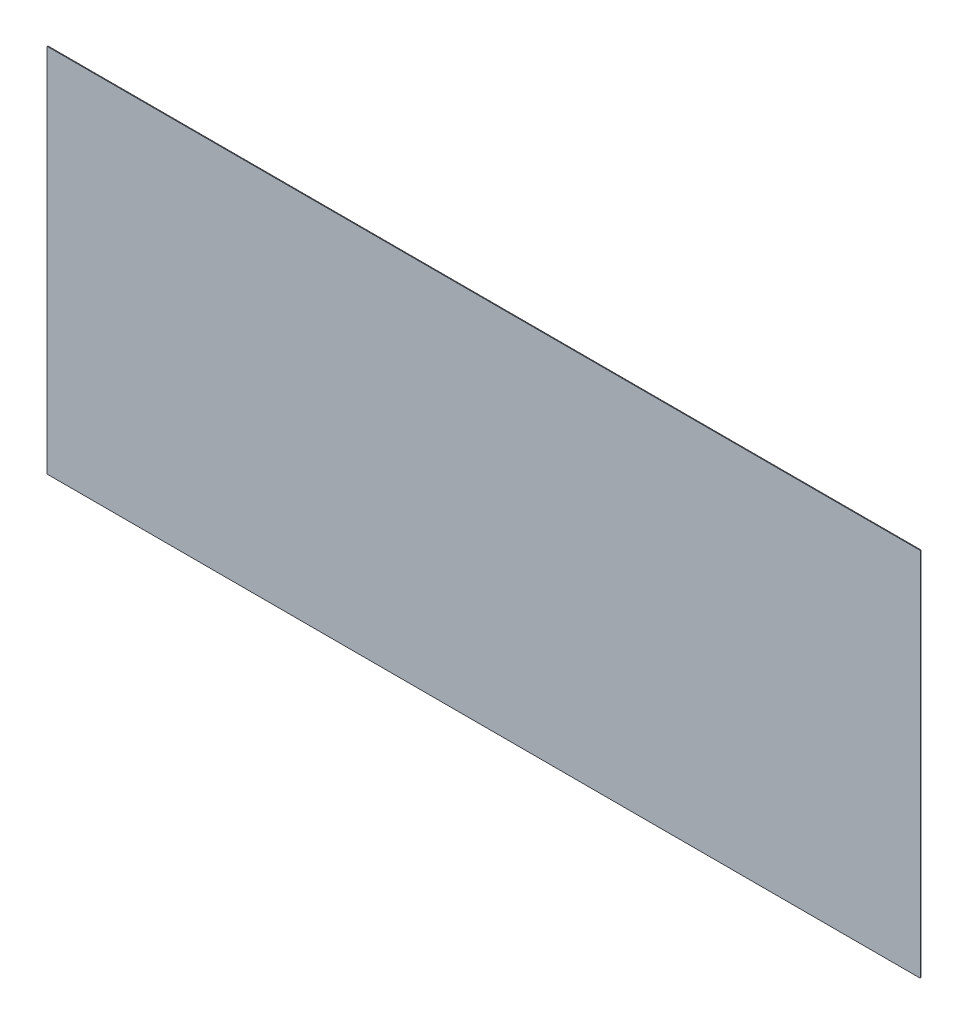
ISO-10303-21;
HEADER;
FILE_DESCRIPTION(('STEP AP214'),'2;1');
FILE_NAME('part.step','',(''),(''),'','','');
FILE_SCHEMA(('AUTOMOTIVE_DESIGN { 1 0 10303 214 1 1 1 1 }'));
ENDSEC;
DATA;
#1=APPLICATION_CONTEXT('core data for automotive mechanical design processes');
#2=APPLICATION_PROTOCOL_DEFINITION('international standard','automotive_design',2000,#1);
#3=PRODUCT_CONTEXT('',#1,'mechanical');
#4=PRODUCT('Part','Part','',(#3));
#5=PRODUCT_RELATED_PRODUCT_CATEGORY('part','',(#4));
#6=PRODUCT_DEFINITION_FORMATION('','',#4);
#7=PRODUCT_DEFINITION_CONTEXT('part definition',#1,'design');
#8=PRODUCT_DEFINITION('design','',#6,#7);
#9=PRODUCT_DEFINITION_SHAPE('','',#8);
#10=(LENGTH_UNIT() NAMED_UNIT(*) SI_UNIT(.MILLI.,.METRE.));
#11=(NAMED_UNIT(*) PLANE_ANGLE_UNIT() SI_UNIT($,.RADIAN.));
#12=(NAMED_UNIT(*) SI_UNIT($,.STERADIAN.) SOLID_ANGLE_UNIT());
#13=UNCERTAINTY_MEASURE_WITH_UNIT(LENGTH_MEASURE(1.E-05),#10,'distance_accuracy_value','');
#14=(GEOMETRIC_REPRESENTATION_CONTEXT(3) GLOBAL_UNCERTAINTY_ASSIGNED_CONTEXT((#13)) GLOBAL_UNIT_ASSIGNED_CONTEXT((#10,
#11,#12)) REPRESENTATION_CONTEXT('',''));
#15=CARTESIAN_POINT('',(0.,0.,0.));
#16=DIRECTION('',(0.,0.,1.));
#17=DIRECTION('',(1.,0.,0.));
#18=AXIS2_PLACEMENT_3D('',#15,#16,#17);
#19=CARTESIAN_POINT('',(1159.,491.,-1.));
#20=DIRECTION('',(0.,0.,1.));
#21=DIRECTION('',(1.,0.,0.));
#22=AXIS2_PLACEMENT_3D('',#19,#20,#21);
#23=CYLINDRICAL_SURFACE('',#22,0.999999999999945);
#24=CARTESIAN_POINT('',(1159.,491.,0.));
#25=DIRECTION('',(0.,0.,1.));
#26=DIRECTION('',(-1.,0.,0.));
#27=AXIS2_PLACEMENT_3D('',#24,#25,#26);
#28=CIRCLE('',#27,0.999999999999945);
#29=CARTESIAN_POINT('',(1160.,491.,0.));
#30=VERTEX_POINT('',#29);
#31=CARTESIAN_POINT('',(1159.,492.,0.));
#32=VERTEX_POINT('',#31);
#33=EDGE_CURVE('E137',#30,#32,#28,.T.);
#34=ORIENTED_EDGE('',*,*,#33,.F.);
#35=DIRECTION('',(0.,0.,1.));
#36=VECTOR('',#35,1.);
#37=CARTESIAN_POINT('',(1160.,491.,-1.));
#38=LINE('',#37,#36);
#39=CARTESIAN_POINT('',(1160.,491.,-1.));
#40=VERTEX_POINT('',#39);
#41=EDGE_CURVE('E11',#40,#30,#38,.T.);
#42=ORIENTED_EDGE('',*,*,#41,.F.);
#43=CARTESIAN_POINT('',(1159.,491.,-1.));
#44=DIRECTION('',(0.,0.,1.));
#45=DIRECTION('',(-1.,0.,0.));
#46=AXIS2_PLACEMENT_3D('',#43,#44,#45);
#47=CIRCLE('',#46,0.999999999999945);
#48=CARTESIAN_POINT('',(1159.,492.,-1.));
#49=VERTEX_POINT('',#48);
#50=EDGE_CURVE('E157',#40,#49,#47,.T.);
#51=ORIENTED_EDGE('',*,*,#50,.T.);
#52=DIRECTION('',(0.,0.,1.));
#53=VECTOR('',#52,1.);
#54=CARTESIAN_POINT('',(1159.,492.,-1.));
#55=LINE('',#54,#53);
#56=EDGE_CURVE('E43',#49,#32,#55,.T.);
#57=ORIENTED_EDGE('',*,*,#56,.T.);
#58=EDGE_LOOP('',(#34,#42,#51,#57));
#59=FACE_BOUND('',#58,.T.);
#60=ADVANCED_FACE('F40',(#59),#23,.T.);
#61=CARTESIAN_POINT('',(1160.,1.00000000000001,-1.));
#62=DIRECTION('',(1.,0.,0.));
#63=DIRECTION('',(0.,0.,-1.));
#64=AXIS2_PLACEMENT_3D('',#61,#62,#63);
#65=PLANE('',#64);
#66=DIRECTION('',(0.,1.,0.));
#67=VECTOR('',#66,1.);
#68=CARTESIAN_POINT('',(1160.,1.00000000000001,0.));
#69=LINE('',#68,#67);
#70=CARTESIAN_POINT('',(1160.,1.,0.));
#71=VERTEX_POINT('',#70);
#72=EDGE_CURVE('E155',#71,#30,#69,.T.);
#73=ORIENTED_EDGE('',*,*,#72,.F.);
#74=DIRECTION('',(0.,0.,1.));
#75=VECTOR('',#74,1.);
#76=CARTESIAN_POINT('',(1160.,1.,-1.));
#77=LINE('',#76,#75);
#78=CARTESIAN_POINT('',(1160.,1.,-1.));
#79=VERTEX_POINT('',#78);
#80=EDGE_CURVE('E49',#79,#71,#77,.T.);
#81=ORIENTED_EDGE('',*,*,#80,.F.);
#82=DIRECTION('',(0.,1.,0.));
#83=VECTOR('',#82,1.);
#84=CARTESIAN_POINT('',(1160.,1.00000000000001,-1.));
#85=LINE('',#84,#83);
#86=EDGE_CURVE('E127',#79,#40,#85,.T.);
#87=ORIENTED_EDGE('',*,*,#86,.T.);
#88=ORIENTED_EDGE('',*,*,#41,.T.);
#89=EDGE_LOOP('',(#73,#81,#87,#88));
#90=FACE_BOUND('',#89,.T.);
#91=ADVANCED_FACE('F169',(#90),#65,.T.);
#92=CARTESIAN_POINT('',(1159.,1.,-1.));
#93=DIRECTION('',(0.,0.,1.));
#94=DIRECTION('',(1.,0.,0.));
#95=AXIS2_PLACEMENT_3D('',#92,#93,#94);
#96=CYLINDRICAL_SURFACE('',#95,0.999999999999945);
#97=CARTESIAN_POINT('',(1159.,1.,0.));
#98=DIRECTION('',(0.,0.,1.));
#99=DIRECTION('',(1.,0.,0.));
#100=AXIS2_PLACEMENT_3D('',#97,#98,#99);
#101=CIRCLE('',#100,0.999999999999945);
#102=CARTESIAN_POINT('',(1159.,0.,0.));
#103=VERTEX_POINT('',#102);
#104=EDGE_CURVE('E114',#103,#71,#101,.T.);
#105=ORIENTED_EDGE('',*,*,#104,.F.);
#106=DIRECTION('',(0.,0.,1.));
#107=VECTOR('',#106,1.);
#108=CARTESIAN_POINT('',(1159.,0.,-1.));
#109=LINE('',#108,#107);
#110=CARTESIAN_POINT('',(1159.,0.,-1.));
#111=VERTEX_POINT('',#110);
#112=EDGE_CURVE('E109',#111,#103,#109,.T.);
#113=ORIENTED_EDGE('',*,*,#112,.F.);
#114=CARTESIAN_POINT('',(1159.,1.,-1.));
#115=DIRECTION('',(0.,0.,1.));
#116=DIRECTION('',(1.,0.,0.));
#117=AXIS2_PLACEMENT_3D('',#114,#115,#116);
#118=CIRCLE('',#117,0.999999999999945);
#119=EDGE_CURVE('E112',#111,#79,#118,.T.);
#120=ORIENTED_EDGE('',*,*,#119,.T.);
#121=ORIENTED_EDGE('',*,*,#80,.T.);
#122=EDGE_LOOP('',(#105,#113,#120,#121));
#123=FACE_BOUND('',#122,.T.);
#124=ADVANCED_FACE('F111',(#123),#96,.T.);
#125=CARTESIAN_POINT('',(1.00000000000001,0.,-1.));
#126=DIRECTION('',(0.,-1.,0.));
#127=DIRECTION('',(0.,0.,-1.));
#128=AXIS2_PLACEMENT_3D('',#125,#126,#127);
#129=PLANE('',#128);
#130=DIRECTION('',(1.,0.,0.));
#131=VECTOR('',#130,1.);
#132=CARTESIAN_POINT('',(1.00000000000001,0.,0.));
#133=LINE('',#132,#131);
#134=CARTESIAN_POINT('',(1.00000000000001,0.,0.));
#135=VERTEX_POINT('',#134);
#136=EDGE_CURVE('E152',#135,#103,#133,.T.);
#137=ORIENTED_EDGE('',*,*,#136,.F.);
#138=DIRECTION('',(0.,0.,1.));
#139=VECTOR('',#138,1.);
#140=CARTESIAN_POINT('',(1.00000000000001,0.,-1.));
#141=LINE('',#140,#139);
#142=CARTESIAN_POINT('',(1.00000000000001,0.,-1.));
#143=VERTEX_POINT('',#142);
#144=EDGE_CURVE('E119',#143,#135,#141,.T.);
#145=ORIENTED_EDGE('',*,*,#144,.F.);
#146=DIRECTION('',(1.,0.,0.));
#147=VECTOR('',#146,1.);
#148=CARTESIAN_POINT('',(1.00000000000001,0.,-1.));
#149=LINE('',#148,#147);
#150=EDGE_CURVE('E125',#143,#111,#149,.T.);
#151=ORIENTED_EDGE('',*,*,#150,.T.);
#152=ORIENTED_EDGE('',*,*,#112,.T.);
#153=EDGE_LOOP('',(#137,#145,#151,#152));
#154=FACE_BOUND('',#153,.T.);
#155=ADVANCED_FACE('F129',(#154),#129,.T.);
#156=CARTESIAN_POINT('',(1.,1.,-1.));
#157=DIRECTION('',(0.,0.,1.));
#158=DIRECTION('',(1.,0.,0.));
#159=AXIS2_PLACEMENT_3D('',#156,#157,#158);
#160=CYLINDRICAL_SURFACE('',#159,1.);
#161=CARTESIAN_POINT('',(1.,1.,0.));
#162=DIRECTION('',(0.,0.,1.));
#163=DIRECTION('',(-1.,0.,0.));
#164=AXIS2_PLACEMENT_3D('',#161,#162,#163);
#165=CIRCLE('',#164,1.);
#166=CARTESIAN_POINT('',(0.,1.00000000000001,0.));
#167=VERTEX_POINT('',#166);
#168=EDGE_CURVE('E149',#167,#135,#165,.T.);
#169=ORIENTED_EDGE('',*,*,#168,.F.);
#170=DIRECTION('',(0.,0.,1.));
#171=VECTOR('',#170,1.);
#172=CARTESIAN_POINT('',(0.,1.00000000000001,-1.));
#173=LINE('',#172,#171);
#174=CARTESIAN_POINT('',(0.,1.00000000000001,-1.));
#175=VERTEX_POINT('',#174);
#176=EDGE_CURVE('E161',#175,#167,#173,.T.);
#177=ORIENTED_EDGE('',*,*,#176,.F.);
#178=CARTESIAN_POINT('',(1.,1.,-1.));
#179=DIRECTION('',(0.,0.,1.));
#180=DIRECTION('',(-1.,0.,0.));
#181=AXIS2_PLACEMENT_3D('',#178,#179,#180);
#182=CIRCLE('',#181,1.);
#183=EDGE_CURVE('E130',#175,#143,#182,.T.);
#184=ORIENTED_EDGE('',*,*,#183,.T.);
#185=ORIENTED_EDGE('',*,*,#144,.T.);
#186=EDGE_LOOP('',(#169,#177,#184,#185));
#187=FACE_BOUND('',#186,.T.);
#188=ADVANCED_FACE('F182',(#187),#160,.T.);
#189=CARTESIAN_POINT('',(0.,1.00000000000001,-1.));
#190=DIRECTION('',(-1.,0.,0.));
#191=DIRECTION('',(0.,0.,1.));
#192=AXIS2_PLACEMENT_3D('',#189,#190,#191);
#193=PLANE('',#192);
#194=DIRECTION('',(0.,-1.,0.));
#195=VECTOR('',#194,1.);
#196=CARTESIAN_POINT('',(0.,1.00000000000001,0.));
#197=LINE('',#196,#195);
#198=CARTESIAN_POINT('',(0.,491.,0.));
#199=VERTEX_POINT('',#198);
#200=EDGE_CURVE('E146',#199,#167,#197,.T.);
#201=ORIENTED_EDGE('',*,*,#200,.F.);
#202=DIRECTION('',(0.,0.,1.));
#203=VECTOR('',#202,1.);
#204=CARTESIAN_POINT('',(0.,491.,-1.));
#205=LINE('',#204,#203);
#206=CARTESIAN_POINT('',(0.,491.,-1.));
#207=VERTEX_POINT('',#206);
#208=EDGE_CURVE('E163',#207,#199,#205,.T.);
#209=ORIENTED_EDGE('',*,*,#208,.F.);
#210=DIRECTION('',(0.,-1.,0.));
#211=VECTOR('',#210,1.);
#212=CARTESIAN_POINT('',(0.,1.00000000000001,-1.));
#213=LINE('',#212,#211);
#214=EDGE_CURVE('E132',#207,#175,#213,.T.);
#215=ORIENTED_EDGE('',*,*,#214,.T.);
#216=ORIENTED_EDGE('',*,*,#176,.T.);
#217=EDGE_LOOP('',(#201,#209,#215,#216));
#218=FACE_BOUND('',#217,.T.);
#219=ADVANCED_FACE('F185',(#218),#193,.T.);
#220=CARTESIAN_POINT('',(1.,491.,-1.));
#221=DIRECTION('',(0.,0.,1.));
#222=DIRECTION('',(1.,0.,0.));
#223=AXIS2_PLACEMENT_3D('',#220,#221,#222);
#224=CYLINDRICAL_SURFACE('',#223,1.);
#225=CARTESIAN_POINT('',(1.,491.,0.));
#226=DIRECTION('',(0.,0.,1.));
#227=DIRECTION('',(-1.,0.,0.));
#228=AXIS2_PLACEMENT_3D('',#225,#226,#227);
#229=CIRCLE('',#228,1.);
#230=CARTESIAN_POINT('',(1.,492.,0.));
#231=VERTEX_POINT('',#230);
#232=EDGE_CURVE('E143',#231,#199,#229,.T.);
#233=ORIENTED_EDGE('',*,*,#232,.F.);
#234=DIRECTION('',(0.,0.,1.));
#235=VECTOR('',#234,1.);
#236=CARTESIAN_POINT('',(1.,492.,-1.));
#237=LINE('',#236,#235);
#238=CARTESIAN_POINT('',(1.,492.,-1.));
#239=VERTEX_POINT('',#238);
#240=EDGE_CURVE('E164',#239,#231,#237,.T.);
#241=ORIENTED_EDGE('',*,*,#240,.F.);
#242=CARTESIAN_POINT('',(1.,491.,-1.));
#243=DIRECTION('',(0.,0.,1.));
#244=DIRECTION('',(-1.,0.,0.));
#245=AXIS2_PLACEMENT_3D('',#242,#243,#244);
#246=CIRCLE('',#245,1.);
#247=EDGE_CURVE('E280',#239,#207,#246,.T.);
#248=ORIENTED_EDGE('',*,*,#247,.T.);
#249=ORIENTED_EDGE('',*,*,#208,.T.);
#250=EDGE_LOOP('',(#233,#241,#248,#249));
#251=FACE_BOUND('',#250,.T.);
#252=ADVANCED_FACE('F189',(#251),#224,.T.);
#253=CARTESIAN_POINT('',(1.,492.,-1.));
#254=DIRECTION('',(0.,1.,0.));
#255=DIRECTION('',(0.,0.,1.));
#256=AXIS2_PLACEMENT_3D('',#253,#254,#255);
#257=PLANE('',#256);
#258=DIRECTION('',(-1.,0.,0.));
#259=VECTOR('',#258,1.);
#260=CARTESIAN_POINT('',(1.,492.,0.));
#261=LINE('',#260,#259);
#262=EDGE_CURVE('E140',#32,#231,#261,.T.);
#263=ORIENTED_EDGE('',*,*,#262,.F.);
#264=ORIENTED_EDGE('',*,*,#56,.F.);
#265=DIRECTION('',(-1.,0.,0.));
#266=VECTOR('',#265,1.);
#267=CARTESIAN_POINT('',(1.,492.,-1.));
#268=LINE('',#267,#266);
#269=EDGE_CURVE('E281',#49,#239,#268,.T.);
#270=ORIENTED_EDGE('',*,*,#269,.T.);
#271=ORIENTED_EDGE('',*,*,#240,.T.);
#272=EDGE_LOOP('',(#263,#264,#270,#271));
#273=FACE_BOUND('',#272,.T.);
#274=ADVANCED_FACE('F166',(#273),#257,.T.);
#275=CARTESIAN_POINT('',(1159.,491.,-1.));
#276=DIRECTION('',(0.,0.,-1.));
#277=DIRECTION('',(-1.,0.,0.));
#278=AXIS2_PLACEMENT_3D('',#275,#276,#277);
#279=PLANE('',#278);
#280=ORIENTED_EDGE('',*,*,#50,.F.);
#281=ORIENTED_EDGE('',*,*,#86,.F.);
#282=ORIENTED_EDGE('',*,*,#119,.F.);
#283=ORIENTED_EDGE('',*,*,#150,.F.);
#284=ORIENTED_EDGE('',*,*,#183,.F.);
#285=ORIENTED_EDGE('',*,*,#214,.F.);
#286=ORIENTED_EDGE('',*,*,#247,.F.);
#287=ORIENTED_EDGE('',*,*,#269,.F.);
#288=EDGE_LOOP('',(#280,#281,#282,#283,#284,#285,#286,#287));
#289=FACE_BOUND('',#288,.T.);
#290=ADVANCED_FACE('F123',(#289),#279,.T.);
#291=CARTESIAN_POINT('',(1159.,491.,0.));
#292=DIRECTION('',(0.,0.,-1.));
#293=DIRECTION('',(-1.,0.,0.));
#294=AXIS2_PLACEMENT_3D('',#291,#292,#293);
#295=PLANE('',#294);
#296=ORIENTED_EDGE('',*,*,#33,.T.);
#297=ORIENTED_EDGE('',*,*,#262,.T.);
#298=ORIENTED_EDGE('',*,*,#232,.T.);
#299=ORIENTED_EDGE('',*,*,#200,.T.);
#300=ORIENTED_EDGE('',*,*,#168,.T.);
#301=ORIENTED_EDGE('',*,*,#136,.T.);
#302=ORIENTED_EDGE('',*,*,#104,.T.);
#303=ORIENTED_EDGE('',*,*,#72,.T.);
#304=EDGE_LOOP('',(#296,#297,#298,#299,#300,#301,#302,#303));
#305=FACE_BOUND('',#304,.T.);
#306=ADVANCED_FACE('F168',(#305),#295,.F.);
#307=CLOSED_SHELL('',(#60,#91,#124,#155,#188,#219,#252,#274,#290,#306));
#308=MANIFOLD_SOLID_BREP('B2',#307);
#309=ADVANCED_BREP_SHAPE_REPRESENTATION('',(#18,#308),#14);
#310=SHAPE_DEFINITION_REPRESENTATION(#9,#309);
ENDSEC;
END-ISO-10303-21;
